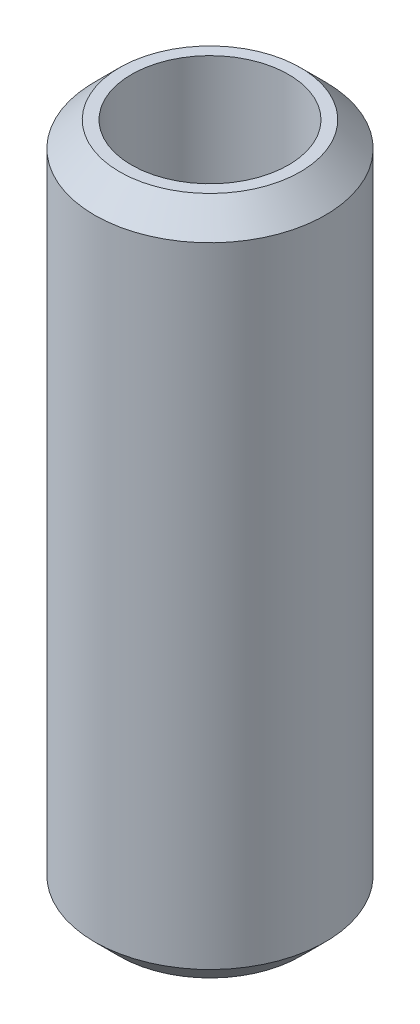
ISO-10303-21;
HEADER;
FILE_DESCRIPTION(('STEP AP214'),'2;1');
FILE_NAME('part.step','',(''),(''),'','','');
FILE_SCHEMA(('AUTOMOTIVE_DESIGN { 1 0 10303 214 1 1 1 1 }'));
ENDSEC;
DATA;
#1=APPLICATION_CONTEXT('core data for automotive mechanical design processes');
#2=APPLICATION_PROTOCOL_DEFINITION('international standard','automotive_design',2000,#1);
#3=PRODUCT_CONTEXT('',#1,'mechanical');
#4=PRODUCT('Part','Part','',(#3));
#5=PRODUCT_RELATED_PRODUCT_CATEGORY('part','',(#4));
#6=PRODUCT_DEFINITION_FORMATION('','',#4);
#7=PRODUCT_DEFINITION_CONTEXT('part definition',#1,'design');
#8=PRODUCT_DEFINITION('design','',#6,#7);
#9=PRODUCT_DEFINITION_SHAPE('','',#8);
#10=(LENGTH_UNIT() NAMED_UNIT(*) SI_UNIT(.MILLI.,.METRE.));
#11=(NAMED_UNIT(*) PLANE_ANGLE_UNIT() SI_UNIT($,.RADIAN.));
#12=(NAMED_UNIT(*) SI_UNIT($,.STERADIAN.) SOLID_ANGLE_UNIT());
#13=UNCERTAINTY_MEASURE_WITH_UNIT(LENGTH_MEASURE(1.E-05),#10,'distance_accuracy_value','');
#14=(GEOMETRIC_REPRESENTATION_CONTEXT(3) GLOBAL_UNCERTAINTY_ASSIGNED_CONTEXT((#13)) GLOBAL_UNIT_ASSIGNED_CONTEXT((#10,
#11,#12)) REPRESENTATION_CONTEXT('',''));
#15=CARTESIAN_POINT('',(0.,0.,0.));
#16=DIRECTION('',(0.,0.,1.));
#17=DIRECTION('',(1.,0.,0.));
#18=AXIS2_PLACEMENT_3D('',#15,#16,#17);
#19=CARTESIAN_POINT('',(0.,147.222688112945,0.));
#20=DIRECTION('',(0.,-1.,0.));
#21=DIRECTION('',(0.,0.,-1.));
#22=AXIS2_PLACEMENT_3D('',#19,#20,#21);
#23=CYLINDRICAL_SURFACE('',#22,25.);
#24=CARTESIAN_POINT('',(0.,141.803283038749,0.));
#25=DIRECTION('',(0.,1.,0.));
#26=DIRECTION('',(0.,0.,1.));
#27=AXIS2_PLACEMENT_3D('',#24,#25,#26);
#28=CIRCLE('',#27,25.);
#29=CARTESIAN_POINT('',(0.,141.803283038749,25.));
#30=VERTEX_POINT('',#29);
#31=EDGE_CURVE('E50',#30,#30,#28,.F.);
#32=ORIENTED_EDGE('',*,*,#31,.T.);
#33=EDGE_LOOP('',(#32));
#34=FACE_BOUND('',#33,.T.);
#35=CARTESIAN_POINT('',(0.,5.41940507419603,0.));
#36=DIRECTION('',(0.,1.,0.));
#37=DIRECTION('',(0.,0.,1.));
#38=AXIS2_PLACEMENT_3D('',#35,#36,#37);
#39=CIRCLE('',#38,25.);
#40=CARTESIAN_POINT('',(0.,5.41940507419603,25.));
#41=VERTEX_POINT('',#40);
#42=EDGE_CURVE('E51',#41,#41,#39,.T.);
#43=ORIENTED_EDGE('',*,*,#42,.T.);
#44=EDGE_LOOP('',(#43));
#45=FACE_BOUND('',#44,.T.);
#46=ADVANCED_FACE('F39',(#34,#45),#23,.T.);
#47=CARTESIAN_POINT('',(0.,147.222688112945,0.));
#48=DIRECTION('',(0.,1.,0.));
#49=DIRECTION('',(0.,0.,1.));
#50=AXIS2_PLACEMENT_3D('',#47,#48,#49);
#51=PLANE('',#50);
#52=CARTESIAN_POINT('',(0.,147.222688112945,0.));
#53=DIRECTION('',(0.,1.,0.));
#54=DIRECTION('',(0.,0.,1.));
#55=AXIS2_PLACEMENT_3D('',#52,#53,#54);
#56=CIRCLE('',#55,19.580594925804);
#57=CARTESIAN_POINT('',(0.,147.222688112945,19.580594925804));
#58=VERTEX_POINT('',#57);
#59=EDGE_CURVE('E54',#58,#58,#56,.T.);
#60=ORIENTED_EDGE('',*,*,#59,.T.);
#61=EDGE_LOOP('',(#60));
#62=FACE_BOUND('',#61,.T.);
#63=CARTESIAN_POINT('',(0.,147.222688112945,0.));
#64=DIRECTION('',(0.,1.,0.));
#65=DIRECTION('',(0.,0.,1.));
#66=AXIS2_PLACEMENT_3D('',#63,#64,#65);
#67=CIRCLE('',#66,17.0145145582596);
#68=CARTESIAN_POINT('',(0.,147.222688112945,17.0145145582596));
#69=VERTEX_POINT('',#68);
#70=EDGE_CURVE('E58',#69,#69,#67,.T.);
#71=ORIENTED_EDGE('',*,*,#70,.F.);
#72=EDGE_LOOP('',(#71));
#73=FACE_BOUND('',#72,.T.);
#74=ADVANCED_FACE('F69',(#62,#73),#51,.T.);
#75=CARTESIAN_POINT('',(0.,0.,0.));
#76=DIRECTION('',(0.,1.,0.));
#77=DIRECTION('',(0.,0.,1.));
#78=AXIS2_PLACEMENT_3D('',#75,#76,#77);
#79=PLANE('',#78);
#80=CARTESIAN_POINT('',(0.,0.,0.));
#81=DIRECTION('',(0.,1.,0.));
#82=DIRECTION('',(0.,0.,1.));
#83=AXIS2_PLACEMENT_3D('',#80,#81,#82);
#84=CIRCLE('',#83,19.5805949258039);
#85=CARTESIAN_POINT('',(0.,0.,19.5805949258039));
#86=VERTEX_POINT('',#85);
#87=EDGE_CURVE('E10',#86,#86,#84,.F.);
#88=ORIENTED_EDGE('',*,*,#87,.T.);
#89=EDGE_LOOP('',(#88));
#90=FACE_BOUND('',#89,.T.);
#91=CARTESIAN_POINT('',(0.,0.,0.));
#92=DIRECTION('',(0.,1.,0.));
#93=DIRECTION('',(0.,0.,1.));
#94=AXIS2_PLACEMENT_3D('',#91,#92,#93);
#95=CIRCLE('',#94,17.0145145582596);
#96=CARTESIAN_POINT('',(0.,0.,17.0145145582596));
#97=VERTEX_POINT('',#96);
#98=EDGE_CURVE('E63',#97,#97,#95,.T.);
#99=ORIENTED_EDGE('',*,*,#98,.T.);
#100=EDGE_LOOP('',(#99));
#101=FACE_BOUND('',#100,.T.);
#102=ADVANCED_FACE('F75',(#90,#101),#79,.F.);
#103=CARTESIAN_POINT('',(0.,147.222688112945,0.));
#104=DIRECTION('',(0.,-1.,0.));
#105=DIRECTION('',(0.,0.,-1.));
#106=AXIS2_PLACEMENT_3D('',#103,#104,#105);
#107=CYLINDRICAL_SURFACE('',#106,17.0145145582596);
#108=ORIENTED_EDGE('',*,*,#70,.T.);
#109=EDGE_LOOP('',(#108));
#110=FACE_BOUND('',#109,.T.);
#111=ORIENTED_EDGE('',*,*,#98,.F.);
#112=EDGE_LOOP('',(#111));
#113=FACE_BOUND('',#112,.T.);
#114=ADVANCED_FACE('F70',(#110,#113),#107,.F.);
#115=CARTESIAN_POINT('',(0.,147.222688112945,0.));
#116=DIRECTION('',(0.,-1.,0.));
#117=DIRECTION('',(0.,0.,-1.));
#118=AXIS2_PLACEMENT_3D('',#115,#116,#117);
#119=CONICAL_SURFACE('',#118,19.580594925804,0.785398163397445);
#120=ORIENTED_EDGE('',*,*,#31,.F.);
#121=EDGE_LOOP('',(#120));
#122=FACE_BOUND('',#121,.T.);
#123=ORIENTED_EDGE('',*,*,#59,.F.);
#124=EDGE_LOOP('',(#123));
#125=FACE_BOUND('',#124,.T.);
#126=ADVANCED_FACE('F81',(#122,#125),#119,.T.);
#127=CARTESIAN_POINT('',(0.,5.41940507419603,0.));
#128=DIRECTION('',(0.,1.,0.));
#129=DIRECTION('',(0.,0.,1.));
#130=AXIS2_PLACEMENT_3D('',#127,#128,#129);
#131=CONICAL_SURFACE('',#130,25.,0.785398163397454);
#132=ORIENTED_EDGE('',*,*,#87,.F.);
#133=EDGE_LOOP('',(#132));
#134=FACE_BOUND('',#133,.T.);
#135=ORIENTED_EDGE('',*,*,#42,.F.);
#136=EDGE_LOOP('',(#135));
#137=FACE_BOUND('',#136,.T.);
#138=ADVANCED_FACE('F45',(#134,#137),#131,.T.);
#139=CLOSED_SHELL('',(#46,#74,#102,#114,#126,#138));
#140=MANIFOLD_SOLID_BREP('B2',#139);
#141=ADVANCED_BREP_SHAPE_REPRESENTATION('',(#18,#140),#14);
#142=SHAPE_DEFINITION_REPRESENTATION(#9,#141);
ENDSEC;
END-ISO-10303-21;
